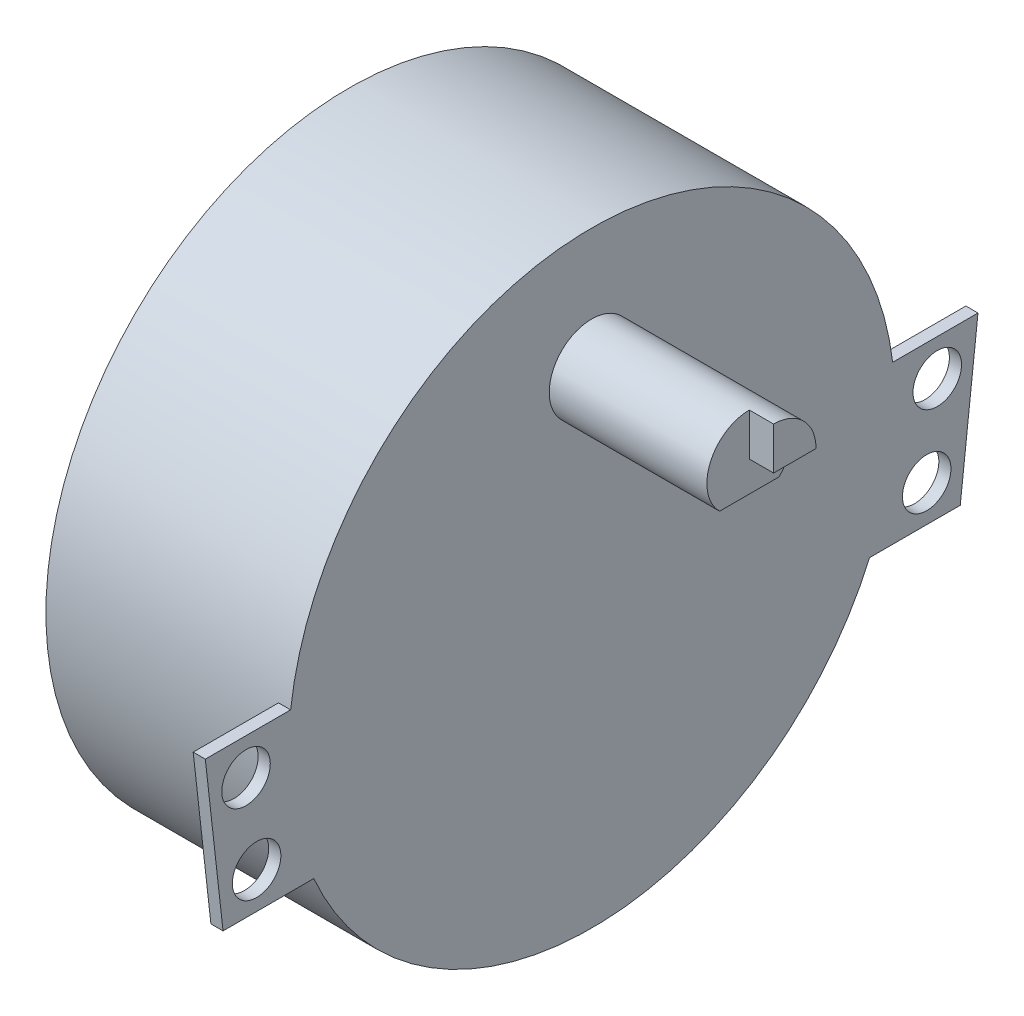
ISO-10303-21;
HEADER;
FILE_DESCRIPTION(('STEP AP214'),'2;1');
FILE_NAME('part.step','',(''),(''),'','','');
FILE_SCHEMA(('AUTOMOTIVE_DESIGN { 1 0 10303 214 1 1 1 1 }'));
ENDSEC;
DATA;
#1=APPLICATION_CONTEXT('core data for automotive mechanical design processes');
#2=APPLICATION_PROTOCOL_DEFINITION('international standard','automotive_design',2000,#1);
#3=PRODUCT_CONTEXT('',#1,'mechanical');
#4=PRODUCT('Part','Part','',(#3));
#5=PRODUCT_RELATED_PRODUCT_CATEGORY('part','',(#4));
#6=PRODUCT_DEFINITION_FORMATION('','',#4);
#7=PRODUCT_DEFINITION_CONTEXT('part definition',#1,'design');
#8=PRODUCT_DEFINITION('design','',#6,#7);
#9=PRODUCT_DEFINITION_SHAPE('','',#8);
#10=(LENGTH_UNIT() NAMED_UNIT(*) SI_UNIT(.MILLI.,.METRE.));
#11=(NAMED_UNIT(*) PLANE_ANGLE_UNIT() SI_UNIT($,.RADIAN.));
#12=(NAMED_UNIT(*) SI_UNIT($,.STERADIAN.) SOLID_ANGLE_UNIT());
#13=UNCERTAINTY_MEASURE_WITH_UNIT(LENGTH_MEASURE(1.E-05),#10,'distance_accuracy_value','');
#14=(GEOMETRIC_REPRESENTATION_CONTEXT(3) GLOBAL_UNCERTAINTY_ASSIGNED_CONTEXT((#13)) GLOBAL_UNIT_ASSIGNED_CONTEXT((#10,
#11,#12)) REPRESENTATION_CONTEXT('',''));
#15=CARTESIAN_POINT('',(0.,0.,0.));
#16=DIRECTION('',(0.,0.,1.));
#17=DIRECTION('',(1.,0.,0.));
#18=AXIS2_PLACEMENT_3D('',#15,#16,#17);
#19=CARTESIAN_POINT('',(35.,12.5,2.44948974278318));
#20=DIRECTION('',(0.,1.,0.));
#21=DIRECTION('',(0.,0.,1.));
#22=AXIS2_PLACEMENT_3D('',#19,#20,#21);
#23=PLANE('',#22);
#24=DIRECTION('',(0.,0.,-1.));
#25=VECTOR('',#24,1.);
#26=CARTESIAN_POINT('',(33.,12.5,2.44948974278318));
#27=LINE('',#26,#25);
#28=CARTESIAN_POINT('',(33.,12.5,2.4494897427832));
#29=VERTEX_POINT('',#28);
#30=CARTESIAN_POINT('',(33.,12.5,-2.4494897427832));
#31=VERTEX_POINT('',#30);
#32=EDGE_CURVE('E11',#29,#31,#27,.T.);
#33=ORIENTED_EDGE('',*,*,#32,.F.);
#34=DIRECTION('',(-1.,0.,0.));
#35=VECTOR('',#34,1.);
#36=CARTESIAN_POINT('',(35.,12.5,2.44948974278318));
#37=LINE('',#36,#35);
#38=CARTESIAN_POINT('',(20.,12.5,2.44948974278318));
#39=VERTEX_POINT('',#38);
#40=EDGE_CURVE('E245',#29,#39,#37,.T.);
#41=ORIENTED_EDGE('',*,*,#40,.T.);
#42=DIRECTION('',(0.,0.,-1.));
#43=VECTOR('',#42,1.);
#44=CARTESIAN_POINT('',(20.,12.5,2.44948974278318));
#45=LINE('',#44,#43);
#46=CARTESIAN_POINT('',(20.,12.5,-2.44948974278318));
#47=VERTEX_POINT('',#46);
#48=EDGE_CURVE('E239',#39,#47,#45,.T.);
#49=ORIENTED_EDGE('',*,*,#48,.T.);
#50=DIRECTION('',(-1.,0.,0.));
#51=VECTOR('',#50,1.);
#52=CARTESIAN_POINT('',(35.,12.5,-2.44948974278318));
#53=LINE('',#52,#51);
#54=EDGE_CURVE('E238',#31,#47,#53,.T.);
#55=ORIENTED_EDGE('',*,*,#54,.F.);
#56=EDGE_LOOP('',(#33,#41,#49,#55));
#57=FACE_BOUND('',#56,.T.);
#58=ADVANCED_FACE('F32',(#57),#23,.F.);
#59=CARTESIAN_POINT('',(20.,0.,0.));
#60=DIRECTION('',(1.,0.,0.));
#61=DIRECTION('',(0.,0.,-1.));
#62=AXIS2_PLACEMENT_3D('',#59,#60,#61);
#63=PLANE('',#62);
#64=CARTESIAN_POINT('',(20.,0.,0.));
#65=DIRECTION('',(1.,0.,0.));
#66=DIRECTION('',(0.,0.,-1.));
#67=AXIS2_PLACEMENT_3D('',#64,#65,#66);
#68=CIRCLE('',#67,25.);
#69=CARTESIAN_POINT('',(20.,-9.99999999999999,22.9128784747792));
#70=VERTEX_POINT('',#69);
#71=CARTESIAN_POINT('',(20.,-10.,-22.9128784747792));
#72=VERTEX_POINT('',#71);
#73=EDGE_CURVE('E40',#70,#72,#68,.T.);
#74=ORIENTED_EDGE('',*,*,#73,.T.);
#75=DIRECTION('',(0.,0.,-1.));
#76=VECTOR('',#75,1.);
#77=CARTESIAN_POINT('',(20.,-9.99999999999999,-30.3928245509555));
#78=LINE('',#77,#76);
#79=CARTESIAN_POINT('',(20.,-9.99999999999999,-30.3928245509555));
#80=VERTEX_POINT('',#79);
#81=EDGE_CURVE('E166',#72,#80,#78,.T.);
#82=ORIENTED_EDGE('',*,*,#81,.T.);
#83=DIRECTION('',(0.,0.993736369390231,-0.111749846313638));
#84=VECTOR('',#83,1.);
#85=CARTESIAN_POINT('',(20.,3.,-31.8547293848992));
#86=LINE('',#85,#84);
#87=CARTESIAN_POINT('',(20.,3.,-31.8547293848992));
#88=VERTEX_POINT('',#87);
#89=EDGE_CURVE('E184',#80,#88,#86,.T.);
#90=ORIENTED_EDGE('',*,*,#89,.T.);
#91=DIRECTION('',(0.,0.,1.));
#92=VECTOR('',#91,1.);
#93=CARTESIAN_POINT('',(20.,3.,-31.8547293848992));
#94=LINE('',#93,#92);
#95=CARTESIAN_POINT('',(20.,3.,-24.8193472919817));
#96=VERTEX_POINT('',#95);
#97=EDGE_CURVE('E55',#88,#96,#94,.T.);
#98=ORIENTED_EDGE('',*,*,#97,.T.);
#99=CARTESIAN_POINT('',(20.,3.,24.8193472919817));
#100=VERTEX_POINT('',#99);
#101=EDGE_CURVE('E249',#96,#100,#68,.T.);
#102=ORIENTED_EDGE('',*,*,#101,.T.);
#103=DIRECTION('',(0.,0.,1.));
#104=VECTOR('',#103,1.);
#105=CARTESIAN_POINT('',(20.,3.,31.8547293848992));
#106=LINE('',#105,#104);
#107=CARTESIAN_POINT('',(20.,3.,31.8547293848992));
#108=VERTEX_POINT('',#107);
#109=EDGE_CURVE('E205',#100,#108,#106,.T.);
#110=ORIENTED_EDGE('',*,*,#109,.T.);
#111=DIRECTION('',(0.,-0.993736369390231,-0.111749846313638));
#112=VECTOR('',#111,1.);
#113=CARTESIAN_POINT('',(20.,3.,31.8547293848992));
#114=LINE('',#113,#112);
#115=CARTESIAN_POINT('',(20.,-9.99999999999999,30.3928245509555));
#116=VERTEX_POINT('',#115);
#117=EDGE_CURVE('E223',#108,#116,#114,.T.);
#118=ORIENTED_EDGE('',*,*,#117,.T.);
#119=DIRECTION('',(0.,0.,-1.));
#120=VECTOR('',#119,1.);
#121=CARTESIAN_POINT('',(20.,-9.99999999999999,30.3928245509555));
#122=LINE('',#121,#120);
#123=EDGE_CURVE('E212',#116,#70,#122,.T.);
#124=ORIENTED_EDGE('',*,*,#123,.T.);
#125=EDGE_LOOP('',(#74,#82,#90,#98,#102,#110,#118,#124));
#126=FACE_BOUND('',#125,.T.);
#127=ORIENTED_EDGE('',*,*,#48,.F.);
#128=CARTESIAN_POINT('',(20.,15.,0.));
#129=DIRECTION('',(1.,0.,0.));
#130=DIRECTION('',(0.,0.,-1.));
#131=AXIS2_PLACEMENT_3D('',#128,#129,#130);
#132=CIRCLE('',#131,3.5);
#133=EDGE_CURVE('E230',#47,#39,#132,.T.);
#134=ORIENTED_EDGE('',*,*,#133,.F.);
#135=EDGE_LOOP('',(#127,#134));
#136=FACE_BOUND('',#135,.T.);
#137=CARTESIAN_POINT('',(20.,-7.,27.6247532840825));
#138=DIRECTION('',(1.,0.,0.));
#139=DIRECTION('',(0.,0.,-1.));
#140=AXIS2_PLACEMENT_3D('',#137,#138,#139);
#141=CIRCLE('',#140,2.);
#142=CARTESIAN_POINT('',(20.,-7.,25.6247532840825));
#143=VERTEX_POINT('',#142);
#144=EDGE_CURVE('E189',#143,#143,#141,.T.);
#145=ORIENTED_EDGE('',*,*,#144,.F.);
#146=EDGE_LOOP('',(#145));
#147=FACE_BOUND('',#146,.T.);
#148=CARTESIAN_POINT('',(20.,0.,28.4978419184055));
#149=DIRECTION('',(1.,0.,0.));
#150=DIRECTION('',(0.,0.,-1.));
#151=AXIS2_PLACEMENT_3D('',#148,#149,#150);
#152=CIRCLE('',#151,2.);
#153=CARTESIAN_POINT('',(20.,0.,26.4978419184055));
#154=VERTEX_POINT('',#153);
#155=EDGE_CURVE('E199',#154,#154,#152,.T.);
#156=ORIENTED_EDGE('',*,*,#155,.F.);
#157=EDGE_LOOP('',(#156));
#158=FACE_BOUND('',#157,.T.);
#159=CARTESIAN_POINT('',(20.,0.,-28.4978419184055));
#160=DIRECTION('',(1.,0.,0.));
#161=DIRECTION('',(0.,0.,1.));
#162=AXIS2_PLACEMENT_3D('',#159,#160,#161);
#163=CIRCLE('',#162,2.);
#164=CARTESIAN_POINT('',(20.,0.,-26.4978419184055));
#165=VERTEX_POINT('',#164);
#166=EDGE_CURVE('E160',#165,#165,#163,.T.);
#167=ORIENTED_EDGE('',*,*,#166,.F.);
#168=EDGE_LOOP('',(#167));
#169=FACE_BOUND('',#168,.T.);
#170=CARTESIAN_POINT('',(20.,-7.,-27.6247532840825));
#171=DIRECTION('',(1.,0.,0.));
#172=DIRECTION('',(0.,0.,1.));
#173=AXIS2_PLACEMENT_3D('',#170,#171,#172);
#174=CIRCLE('',#173,2.);
#175=CARTESIAN_POINT('',(20.,-7.,-25.6247532840825));
#176=VERTEX_POINT('',#175);
#177=EDGE_CURVE('E159',#176,#176,#174,.T.);
#178=ORIENTED_EDGE('',*,*,#177,.F.);
#179=EDGE_LOOP('',(#178));
#180=FACE_BOUND('',#179,.T.);
#181=ADVANCED_FACE('F255',(#126,#136,#147,#158,#169,#180),#63,.T.);
#182=CARTESIAN_POINT('',(20.,0.,0.));
#183=DIRECTION('',(-1.,0.,0.));
#184=DIRECTION('',(0.,0.,1.));
#185=AXIS2_PLACEMENT_3D('',#182,#183,#184);
#186=CYLINDRICAL_SURFACE('',#185,25.);
#187=ORIENTED_EDGE('',*,*,#101,.F.);
#188=DIRECTION('',(1.,0.,0.));
#189=VECTOR('',#188,1.);
#190=CARTESIAN_POINT('',(19.,3.,-24.8193472919817));
#191=LINE('',#190,#189);
#192=CARTESIAN_POINT('',(19.,3.,-24.8193472919817));
#193=VERTEX_POINT('',#192);
#194=EDGE_CURVE('E187',#193,#96,#191,.T.);
#195=ORIENTED_EDGE('',*,*,#194,.F.);
#196=CARTESIAN_POINT('',(19.,0.,0.));
#197=DIRECTION('',(-1.,0.,0.));
#198=DIRECTION('',(0.,0.,1.));
#199=AXIS2_PLACEMENT_3D('',#196,#197,#198);
#200=CIRCLE('',#199,25.);
#201=CARTESIAN_POINT('',(19.,-10.,-22.9128784747792));
#202=VERTEX_POINT('',#201);
#203=EDGE_CURVE('E169',#193,#202,#200,.T.);
#204=ORIENTED_EDGE('',*,*,#203,.T.);
#205=DIRECTION('',(1.,0.,0.));
#206=VECTOR('',#205,1.);
#207=CARTESIAN_POINT('',(19.,-10.,-22.9128784747792));
#208=LINE('',#207,#206);
#209=EDGE_CURVE('E181',#202,#72,#208,.T.);
#210=ORIENTED_EDGE('',*,*,#209,.T.);
#211=ORIENTED_EDGE('',*,*,#73,.F.);
#212=DIRECTION('',(1.,0.,0.));
#213=VECTOR('',#212,1.);
#214=CARTESIAN_POINT('',(19.,-10.,22.9128784747792));
#215=LINE('',#214,#213);
#216=CARTESIAN_POINT('',(19.,-10.,22.9128784747792));
#217=VERTEX_POINT('',#216);
#218=EDGE_CURVE('E231',#217,#70,#215,.T.);
#219=ORIENTED_EDGE('',*,*,#218,.F.);
#220=CARTESIAN_POINT('',(19.,0.,0.));
#221=DIRECTION('',(-1.,0.,0.));
#222=DIRECTION('',(0.,0.,-1.));
#223=AXIS2_PLACEMENT_3D('',#220,#221,#222);
#224=CIRCLE('',#223,25.);
#225=CARTESIAN_POINT('',(19.,3.,24.8193472919817));
#226=VERTEX_POINT('',#225);
#227=EDGE_CURVE('E217',#217,#226,#224,.T.);
#228=ORIENTED_EDGE('',*,*,#227,.T.);
#229=DIRECTION('',(1.,0.,0.));
#230=VECTOR('',#229,1.);
#231=CARTESIAN_POINT('',(19.,3.,24.8193472919817));
#232=LINE('',#231,#230);
#233=EDGE_CURVE('E227',#226,#100,#232,.T.);
#234=ORIENTED_EDGE('',*,*,#233,.T.);
#235=EDGE_LOOP('',(#187,#195,#204,#210,#211,#219,#228,#234));
#236=FACE_BOUND('',#235,.T.);
#237=CARTESIAN_POINT('',(0.,0.,0.));
#238=DIRECTION('',(1.,0.,0.));
#239=DIRECTION('',(0.,0.,-1.));
#240=AXIS2_PLACEMENT_3D('',#237,#238,#239);
#241=CIRCLE('',#240,25.);
#242=CARTESIAN_POINT('',(0.,0.,-25.));
#243=VERTEX_POINT('',#242);
#244=EDGE_CURVE('E247',#243,#243,#241,.T.);
#245=ORIENTED_EDGE('',*,*,#244,.T.);
#246=EDGE_LOOP('',(#245));
#247=FACE_BOUND('',#246,.T.);
#248=ADVANCED_FACE('F34',(#236,#247),#186,.T.);
#249=CARTESIAN_POINT('',(0.,0.,0.));
#250=DIRECTION('',(1.,0.,0.));
#251=DIRECTION('',(0.,0.,-1.));
#252=AXIS2_PLACEMENT_3D('',#249,#250,#251);
#253=PLANE('',#252);
#254=ORIENTED_EDGE('',*,*,#244,.F.);
#255=EDGE_LOOP('',(#254));
#256=FACE_BOUND('',#255,.T.);
#257=ADVANCED_FACE('F311',(#256),#253,.F.);
#258=CARTESIAN_POINT('',(35.,15.,0.));
#259=DIRECTION('',(-1.,0.,0.));
#260=DIRECTION('',(0.,0.,1.));
#261=AXIS2_PLACEMENT_3D('',#258,#259,#260);
#262=CYLINDRICAL_SURFACE('',#261,3.5);
#263=CARTESIAN_POINT('',(33.,15.,0.));
#264=DIRECTION('',(1.,0.,0.));
#265=DIRECTION('',(0.,0.,-1.));
#266=AXIS2_PLACEMENT_3D('',#263,#264,#265);
#267=CIRCLE('',#266,3.50000000000001);
#268=CARTESIAN_POINT('',(33.,18.5,0.));
#269=VERTEX_POINT('',#268);
#270=EDGE_CURVE('E137',#269,#29,#267,.T.);
#271=ORIENTED_EDGE('',*,*,#270,.F.);
#272=DIRECTION('',(1.,0.,0.));
#273=VECTOR('',#272,1.);
#274=CARTESIAN_POINT('',(33.,18.5,0.));
#275=LINE('',#274,#273);
#276=CARTESIAN_POINT('',(35.,18.5,0.));
#277=VERTEX_POINT('',#276);
#278=EDGE_CURVE('E151',#269,#277,#275,.T.);
#279=ORIENTED_EDGE('',*,*,#278,.T.);
#280=CARTESIAN_POINT('',(35.,15.,0.));
#281=DIRECTION('',(1.,0.,0.));
#282=DIRECTION('',(0.,0.,-1.));
#283=AXIS2_PLACEMENT_3D('',#280,#281,#282);
#284=CIRCLE('',#283,3.5);
#285=CARTESIAN_POINT('',(35.,15.,-3.5));
#286=VERTEX_POINT('',#285);
#287=EDGE_CURVE('E149',#286,#277,#284,.T.);
#288=ORIENTED_EDGE('',*,*,#287,.F.);
#289=DIRECTION('',(1.,0.,0.));
#290=VECTOR('',#289,1.);
#291=CARTESIAN_POINT('',(33.,15.,-3.5));
#292=LINE('',#291,#290);
#293=CARTESIAN_POINT('',(33.,15.,-3.5));
#294=VERTEX_POINT('',#293);
#295=EDGE_CURVE('E47',#294,#286,#292,.T.);
#296=ORIENTED_EDGE('',*,*,#295,.F.);
#297=EDGE_CURVE('E129',#31,#294,#267,.T.);
#298=ORIENTED_EDGE('',*,*,#297,.F.);
#299=ORIENTED_EDGE('',*,*,#54,.T.);
#300=ORIENTED_EDGE('',*,*,#133,.T.);
#301=ORIENTED_EDGE('',*,*,#40,.F.);
#302=EDGE_LOOP('',(#271,#279,#288,#296,#298,#299,#300,#301));
#303=FACE_BOUND('',#302,.T.);
#304=ADVANCED_FACE('F146',(#303),#262,.T.);
#305=CARTESIAN_POINT('',(35.,15.,0.));
#306=DIRECTION('',(1.,0.,0.));
#307=DIRECTION('',(0.,0.,-1.));
#308=AXIS2_PLACEMENT_3D('',#305,#306,#307);
#309=PLANE('',#308);
#310=DIRECTION('',(0.,1.,0.));
#311=VECTOR('',#310,1.);
#312=CARTESIAN_POINT('',(35.,15.,0.));
#313=LINE('',#312,#311);
#314=CARTESIAN_POINT('',(35.,15.,0.));
#315=VERTEX_POINT('',#314);
#316=EDGE_CURVE('E138',#315,#277,#313,.T.);
#317=ORIENTED_EDGE('',*,*,#316,.F.);
#318=DIRECTION('',(0.,0.,1.));
#319=VECTOR('',#318,1.);
#320=CARTESIAN_POINT('',(35.,15.,0.));
#321=LINE('',#320,#319);
#322=EDGE_CURVE('E494',#286,#315,#321,.T.);
#323=ORIENTED_EDGE('',*,*,#322,.F.);
#324=ORIENTED_EDGE('',*,*,#287,.T.);
#325=EDGE_LOOP('',(#317,#323,#324));
#326=FACE_BOUND('',#325,.T.);
#327=ADVANCED_FACE('F308',(#326),#309,.T.);
#328=CARTESIAN_POINT('',(19.,3.,31.8547293848992));
#329=DIRECTION('',(0.,1.,0.));
#330=DIRECTION('',(0.,0.,1.));
#331=AXIS2_PLACEMENT_3D('',#328,#329,#330);
#332=PLANE('',#331);
#333=ORIENTED_EDGE('',*,*,#109,.F.);
#334=ORIENTED_EDGE('',*,*,#233,.F.);
#335=DIRECTION('',(0.,0.,1.));
#336=VECTOR('',#335,1.);
#337=CARTESIAN_POINT('',(19.,3.,31.8547293848992));
#338=LINE('',#337,#336);
#339=CARTESIAN_POINT('',(19.,3.,31.8547293848992));
#340=VERTEX_POINT('',#339);
#341=EDGE_CURVE('E208',#226,#340,#338,.T.);
#342=ORIENTED_EDGE('',*,*,#341,.T.);
#343=DIRECTION('',(1.,0.,0.));
#344=VECTOR('',#343,1.);
#345=CARTESIAN_POINT('',(19.,3.,31.8547293848992));
#346=LINE('',#345,#344);
#347=EDGE_CURVE('E220',#340,#108,#346,.T.);
#348=ORIENTED_EDGE('',*,*,#347,.T.);
#349=EDGE_LOOP('',(#333,#334,#342,#348));
#350=FACE_BOUND('',#349,.T.);
#351=ADVANCED_FACE('F260',(#350),#332,.T.);
#352=CARTESIAN_POINT('',(19.,-9.99999999999999,30.3928245509555));
#353=DIRECTION('',(0.,-1.,0.));
#354=DIRECTION('',(0.,0.,-1.));
#355=AXIS2_PLACEMENT_3D('',#352,#353,#354);
#356=PLANE('',#355);
#357=ORIENTED_EDGE('',*,*,#123,.F.);
#358=DIRECTION('',(1.,0.,0.));
#359=VECTOR('',#358,1.);
#360=CARTESIAN_POINT('',(19.,-9.99999999999999,30.3928245509555));
#361=LINE('',#360,#359);
#362=CARTESIAN_POINT('',(19.,-9.99999999999999,30.3928245509555));
#363=VERTEX_POINT('',#362);
#364=EDGE_CURVE('E234',#363,#116,#361,.T.);
#365=ORIENTED_EDGE('',*,*,#364,.F.);
#366=DIRECTION('',(0.,0.,-1.));
#367=VECTOR('',#366,1.);
#368=CARTESIAN_POINT('',(19.,-9.99999999999999,30.3928245509555));
#369=LINE('',#368,#367);
#370=EDGE_CURVE('E215',#363,#217,#369,.T.);
#371=ORIENTED_EDGE('',*,*,#370,.T.);
#372=ORIENTED_EDGE('',*,*,#218,.T.);
#373=EDGE_LOOP('',(#357,#365,#371,#372));
#374=FACE_BOUND('',#373,.T.);
#375=ADVANCED_FACE('F274',(#374),#356,.T.);
#376=CARTESIAN_POINT('',(19.,3.,31.8547293848992));
#377=DIRECTION('',(0.,-0.111749846313638,0.993736369390231));
#378=DIRECTION('',(0.,-0.993736369390232,-0.111749846313638));
#379=AXIS2_PLACEMENT_3D('',#376,#377,#378);
#380=PLANE('',#379);
#381=ORIENTED_EDGE('',*,*,#117,.F.);
#382=ORIENTED_EDGE('',*,*,#347,.F.);
#383=DIRECTION('',(0.,-0.993736369390231,-0.111749846313638));
#384=VECTOR('',#383,1.);
#385=CARTESIAN_POINT('',(19.,3.,31.8547293848992));
#386=LINE('',#385,#384);
#387=EDGE_CURVE('E211',#340,#363,#386,.T.);
#388=ORIENTED_EDGE('',*,*,#387,.T.);
#389=ORIENTED_EDGE('',*,*,#364,.T.);
#390=EDGE_LOOP('',(#381,#382,#388,#389));
#391=FACE_BOUND('',#390,.T.);
#392=ADVANCED_FACE('F271',(#391),#380,.T.);
#393=CARTESIAN_POINT('',(19.,0.,0.));
#394=DIRECTION('',(1.,0.,0.));
#395=DIRECTION('',(0.,0.,-1.));
#396=AXIS2_PLACEMENT_3D('',#393,#394,#395);
#397=PLANE('',#396);
#398=CARTESIAN_POINT('',(19.,-7.,27.6247532840825));
#399=DIRECTION('',(1.,0.,0.));
#400=DIRECTION('',(0.,0.,-1.));
#401=AXIS2_PLACEMENT_3D('',#398,#399,#400);
#402=CIRCLE('',#401,2.);
#403=CARTESIAN_POINT('',(19.,-7.,25.6247532840825));
#404=VERTEX_POINT('',#403);
#405=EDGE_CURVE('E196',#404,#404,#402,.T.);
#406=ORIENTED_EDGE('',*,*,#405,.T.);
#407=EDGE_LOOP('',(#406));
#408=FACE_BOUND('',#407,.T.);
#409=CARTESIAN_POINT('',(19.,0.,28.4978419184055));
#410=DIRECTION('',(1.,0.,0.));
#411=DIRECTION('',(0.,0.,-1.));
#412=AXIS2_PLACEMENT_3D('',#409,#410,#411);
#413=CIRCLE('',#412,2.);
#414=CARTESIAN_POINT('',(19.,0.,26.4978419184055));
#415=VERTEX_POINT('',#414);
#416=EDGE_CURVE('E202',#415,#415,#413,.T.);
#417=ORIENTED_EDGE('',*,*,#416,.T.);
#418=EDGE_LOOP('',(#417));
#419=FACE_BOUND('',#418,.T.);
#420=ORIENTED_EDGE('',*,*,#341,.F.);
#421=ORIENTED_EDGE('',*,*,#227,.F.);
#422=ORIENTED_EDGE('',*,*,#370,.F.);
#423=ORIENTED_EDGE('',*,*,#387,.F.);
#424=EDGE_LOOP('',(#420,#421,#422,#423));
#425=FACE_BOUND('',#424,.T.);
#426=ADVANCED_FACE('F268',(#408,#419,#425),#397,.F.);
#427=CARTESIAN_POINT('',(19.,0.,28.4978419184055));
#428=DIRECTION('',(1.,0.,0.));
#429=DIRECTION('',(0.,0.,-1.));
#430=AXIS2_PLACEMENT_3D('',#427,#428,#429);
#431=CYLINDRICAL_SURFACE('',#430,2.);
#432=ORIENTED_EDGE('',*,*,#416,.F.);
#433=EDGE_LOOP('',(#432));
#434=FACE_BOUND('',#433,.T.);
#435=ORIENTED_EDGE('',*,*,#155,.T.);
#436=EDGE_LOOP('',(#435));
#437=FACE_BOUND('',#436,.T.);
#438=ADVANCED_FACE('F295',(#434,#437),#431,.F.);
#439=CARTESIAN_POINT('',(19.,-7.,27.6247532840825));
#440=DIRECTION('',(1.,0.,0.));
#441=DIRECTION('',(0.,0.,-1.));
#442=AXIS2_PLACEMENT_3D('',#439,#440,#441);
#443=CYLINDRICAL_SURFACE('',#442,2.);
#444=ORIENTED_EDGE('',*,*,#405,.F.);
#445=EDGE_LOOP('',(#444));
#446=FACE_BOUND('',#445,.T.);
#447=ORIENTED_EDGE('',*,*,#144,.T.);
#448=EDGE_LOOP('',(#447));
#449=FACE_BOUND('',#448,.T.);
#450=ADVANCED_FACE('F288',(#446,#449),#443,.F.);
#451=CARTESIAN_POINT('',(19.,3.,-31.8547293848992));
#452=DIRECTION('',(0.,1.,0.));
#453=DIRECTION('',(0.,0.,1.));
#454=AXIS2_PLACEMENT_3D('',#451,#452,#453);
#455=PLANE('',#454);
#456=ORIENTED_EDGE('',*,*,#97,.F.);
#457=DIRECTION('',(1.,0.,0.));
#458=VECTOR('',#457,1.);
#459=CARTESIAN_POINT('',(19.,3.,-31.8547293848992));
#460=LINE('',#459,#458);
#461=CARTESIAN_POINT('',(19.,3.,-31.8547293848992));
#462=VERTEX_POINT('',#461);
#463=EDGE_CURVE('E190',#462,#88,#460,.T.);
#464=ORIENTED_EDGE('',*,*,#463,.F.);
#465=DIRECTION('',(0.,0.,1.));
#466=VECTOR('',#465,1.);
#467=CARTESIAN_POINT('',(19.,3.,-31.8547293848992));
#468=LINE('',#467,#466);
#469=EDGE_CURVE('E178',#462,#193,#468,.T.);
#470=ORIENTED_EDGE('',*,*,#469,.T.);
#471=ORIENTED_EDGE('',*,*,#194,.T.);
#472=EDGE_LOOP('',(#456,#464,#470,#471));
#473=FACE_BOUND('',#472,.T.);
#474=ADVANCED_FACE('F286',(#473),#455,.T.);
#475=CARTESIAN_POINT('',(19.,3.,-31.8547293848992));
#476=DIRECTION('',(0.,-0.111749846313638,-0.993736369390231));
#477=DIRECTION('',(0.,0.993736369390232,-0.111749846313638));
#478=AXIS2_PLACEMENT_3D('',#475,#476,#477);
#479=PLANE('',#478);
#480=ORIENTED_EDGE('',*,*,#89,.F.);
#481=DIRECTION('',(1.,0.,0.));
#482=VECTOR('',#481,1.);
#483=CARTESIAN_POINT('',(19.,-9.99999999999999,-30.3928245509555));
#484=LINE('',#483,#482);
#485=CARTESIAN_POINT('',(19.,-9.99999999999999,-30.3928245509555));
#486=VERTEX_POINT('',#485);
#487=EDGE_CURVE('E192',#486,#80,#484,.T.);
#488=ORIENTED_EDGE('',*,*,#487,.F.);
#489=DIRECTION('',(0.,0.993736369390231,-0.111749846313638));
#490=VECTOR('',#489,1.);
#491=CARTESIAN_POINT('',(19.,3.,-31.8547293848992));
#492=LINE('',#491,#490);
#493=EDGE_CURVE('E175',#486,#462,#492,.T.);
#494=ORIENTED_EDGE('',*,*,#493,.T.);
#495=ORIENTED_EDGE('',*,*,#463,.T.);
#496=EDGE_LOOP('',(#480,#488,#494,#495));
#497=FACE_BOUND('',#496,.T.);
#498=ADVANCED_FACE('F284',(#497),#479,.T.);
#499=CARTESIAN_POINT('',(19.,-9.99999999999999,-30.3928245509555));
#500=DIRECTION('',(0.,-1.,0.));
#501=DIRECTION('',(0.,0.,-1.));
#502=AXIS2_PLACEMENT_3D('',#499,#500,#501);
#503=PLANE('',#502);
#504=ORIENTED_EDGE('',*,*,#81,.F.);
#505=ORIENTED_EDGE('',*,*,#209,.F.);
#506=DIRECTION('',(0.,0.,-1.));
#507=VECTOR('',#506,1.);
#508=CARTESIAN_POINT('',(19.,-9.99999999999999,-30.3928245509555));
#509=LINE('',#508,#507);
#510=EDGE_CURVE('E172',#202,#486,#509,.T.);
#511=ORIENTED_EDGE('',*,*,#510,.T.);
#512=ORIENTED_EDGE('',*,*,#487,.T.);
#513=EDGE_LOOP('',(#504,#505,#511,#512));
#514=FACE_BOUND('',#513,.T.);
#515=ADVANCED_FACE('F277',(#514),#503,.T.);
#516=CARTESIAN_POINT('',(19.,0.,0.));
#517=DIRECTION('',(-1.,0.,0.));
#518=DIRECTION('',(0.,0.,1.));
#519=AXIS2_PLACEMENT_3D('',#516,#517,#518);
#520=PLANE('',#519);
#521=CARTESIAN_POINT('',(19.,0.,-28.4978419184055));
#522=DIRECTION('',(1.,0.,0.));
#523=DIRECTION('',(0.,0.,1.));
#524=AXIS2_PLACEMENT_3D('',#521,#522,#523);
#525=CIRCLE('',#524,2.);
#526=CARTESIAN_POINT('',(19.,0.,-26.4978419184055));
#527=VERTEX_POINT('',#526);
#528=EDGE_CURVE('E156',#527,#527,#525,.T.);
#529=ORIENTED_EDGE('',*,*,#528,.T.);
#530=EDGE_LOOP('',(#529));
#531=FACE_BOUND('',#530,.T.);
#532=CARTESIAN_POINT('',(19.,-7.,-27.6247532840825));
#533=DIRECTION('',(1.,0.,0.));
#534=DIRECTION('',(0.,0.,1.));
#535=AXIS2_PLACEMENT_3D('',#532,#533,#534);
#536=CIRCLE('',#535,2.);
#537=CARTESIAN_POINT('',(19.,-7.,-25.6247532840825));
#538=VERTEX_POINT('',#537);
#539=EDGE_CURVE('E163',#538,#538,#536,.T.);
#540=ORIENTED_EDGE('',*,*,#539,.T.);
#541=EDGE_LOOP('',(#540));
#542=FACE_BOUND('',#541,.T.);
#543=ORIENTED_EDGE('',*,*,#203,.F.);
#544=ORIENTED_EDGE('',*,*,#469,.F.);
#545=ORIENTED_EDGE('',*,*,#493,.F.);
#546=ORIENTED_EDGE('',*,*,#510,.F.);
#547=EDGE_LOOP('',(#543,#544,#545,#546));
#548=FACE_BOUND('',#547,.T.);
#549=ADVANCED_FACE('F280',(#531,#542,#548),#520,.T.);
#550=CARTESIAN_POINT('',(19.,-7.,-27.6247532840825));
#551=DIRECTION('',(1.,0.,0.));
#552=DIRECTION('',(0.,0.,-1.));
#553=AXIS2_PLACEMENT_3D('',#550,#551,#552);
#554=CYLINDRICAL_SURFACE('',#553,2.);
#555=ORIENTED_EDGE('',*,*,#539,.F.);
#556=EDGE_LOOP('',(#555));
#557=FACE_BOUND('',#556,.T.);
#558=ORIENTED_EDGE('',*,*,#177,.T.);
#559=EDGE_LOOP('',(#558));
#560=FACE_BOUND('',#559,.T.);
#561=ADVANCED_FACE('F386',(#557,#560),#554,.F.);
#562=CARTESIAN_POINT('',(19.,0.,-28.4978419184055));
#563=DIRECTION('',(1.,0.,0.));
#564=DIRECTION('',(0.,0.,-1.));
#565=AXIS2_PLACEMENT_3D('',#562,#563,#564);
#566=CYLINDRICAL_SURFACE('',#565,2.);
#567=ORIENTED_EDGE('',*,*,#528,.F.);
#568=EDGE_LOOP('',(#567));
#569=FACE_BOUND('',#568,.T.);
#570=ORIENTED_EDGE('',*,*,#166,.T.);
#571=EDGE_LOOP('',(#570));
#572=FACE_BOUND('',#571,.T.);
#573=ADVANCED_FACE('F361',(#569,#572),#566,.F.);
#574=CARTESIAN_POINT('',(33.,15.,0.));
#575=DIRECTION('',(1.,0.,0.));
#576=DIRECTION('',(0.,0.,-1.));
#577=AXIS2_PLACEMENT_3D('',#574,#575,#576);
#578=PLANE('',#577);
#579=ORIENTED_EDGE('',*,*,#32,.T.);
#580=ORIENTED_EDGE('',*,*,#297,.T.);
#581=DIRECTION('',(0.,0.,1.));
#582=VECTOR('',#581,1.);
#583=CARTESIAN_POINT('',(33.,15.,0.));
#584=LINE('',#583,#582);
#585=CARTESIAN_POINT('',(33.,15.,0.));
#586=VERTEX_POINT('',#585);
#587=EDGE_CURVE('E132',#294,#586,#584,.T.);
#588=ORIENTED_EDGE('',*,*,#587,.T.);
#589=DIRECTION('',(0.,1.,0.));
#590=VECTOR('',#589,1.);
#591=CARTESIAN_POINT('',(33.,15.,0.));
#592=LINE('',#591,#590);
#593=EDGE_CURVE('E142',#586,#269,#592,.T.);
#594=ORIENTED_EDGE('',*,*,#593,.T.);
#595=ORIENTED_EDGE('',*,*,#270,.T.);
#596=EDGE_LOOP('',(#579,#580,#588,#594,#595));
#597=FACE_BOUND('',#596,.T.);
#598=ADVANCED_FACE('F130',(#597),#578,.T.);
#599=CARTESIAN_POINT('',(33.,15.,0.));
#600=DIRECTION('',(0.,0.,-1.));
#601=DIRECTION('',(0.,1.,0.));
#602=AXIS2_PLACEMENT_3D('',#599,#600,#601);
#603=PLANE('',#602);
#604=ORIENTED_EDGE('',*,*,#316,.T.);
#605=ORIENTED_EDGE('',*,*,#278,.F.);
#606=ORIENTED_EDGE('',*,*,#593,.F.);
#607=DIRECTION('',(1.,0.,0.));
#608=VECTOR('',#607,1.);
#609=CARTESIAN_POINT('',(33.,15.,0.));
#610=LINE('',#609,#608);
#611=EDGE_CURVE('E141',#586,#315,#610,.T.);
#612=ORIENTED_EDGE('',*,*,#611,.T.);
#613=EDGE_LOOP('',(#604,#605,#606,#612));
#614=FACE_BOUND('',#613,.T.);
#615=ADVANCED_FACE('F360',(#614),#603,.F.);
#616=CARTESIAN_POINT('',(33.,15.,0.));
#617=DIRECTION('',(0.,1.,0.));
#618=DIRECTION('',(0.,0.,1.));
#619=AXIS2_PLACEMENT_3D('',#616,#617,#618);
#620=PLANE('',#619);
#621=ORIENTED_EDGE('',*,*,#322,.T.);
#622=ORIENTED_EDGE('',*,*,#611,.F.);
#623=ORIENTED_EDGE('',*,*,#587,.F.);
#624=ORIENTED_EDGE('',*,*,#295,.T.);
#625=EDGE_LOOP('',(#621,#622,#623,#624));
#626=FACE_BOUND('',#625,.T.);
#627=ADVANCED_FACE('F140',(#626),#620,.F.);
#628=CLOSED_SHELL('',(#58,#181,#248,#257,#304,#327,#351,#375,#392,#426,#438,#450,#474,#498,#515,
#549,#561,#573,#598,#615,#627));
#629=MANIFOLD_SOLID_BREP('B2',#628);
#630=ADVANCED_BREP_SHAPE_REPRESENTATION('',(#18,#629),#14);
#631=SHAPE_DEFINITION_REPRESENTATION(#9,#630);
ENDSEC;
END-ISO-10303-21;
